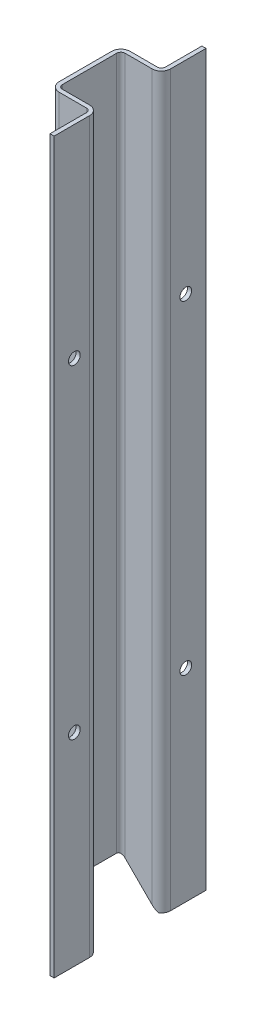
ISO-10303-21;
HEADER;
FILE_DESCRIPTION(('STEP AP214'),'2;1');
FILE_NAME('part.step','',(''),(''),'','','');
FILE_SCHEMA(('AUTOMOTIVE_DESIGN { 1 0 10303 214 1 1 1 1 }'));
ENDSEC;
DATA;
#1=APPLICATION_CONTEXT('core data for automotive mechanical design processes');
#2=APPLICATION_PROTOCOL_DEFINITION('international standard','automotive_design',2000,#1);
#3=PRODUCT_CONTEXT('',#1,'mechanical');
#4=PRODUCT('Part','Part','',(#3));
#5=PRODUCT_RELATED_PRODUCT_CATEGORY('part','',(#4));
#6=PRODUCT_DEFINITION_FORMATION('','',#4);
#7=PRODUCT_DEFINITION_CONTEXT('part definition',#1,'design');
#8=PRODUCT_DEFINITION('design','',#6,#7);
#9=PRODUCT_DEFINITION_SHAPE('','',#8);
#10=(LENGTH_UNIT() NAMED_UNIT(*) SI_UNIT(.MILLI.,.METRE.));
#11=(NAMED_UNIT(*) PLANE_ANGLE_UNIT() SI_UNIT($,.RADIAN.));
#12=(NAMED_UNIT(*) SI_UNIT($,.STERADIAN.) SOLID_ANGLE_UNIT());
#13=UNCERTAINTY_MEASURE_WITH_UNIT(LENGTH_MEASURE(1.E-05),#10,'distance_accuracy_value','');
#14=(GEOMETRIC_REPRESENTATION_CONTEXT(3) GLOBAL_UNCERTAINTY_ASSIGNED_CONTEXT((#13)) GLOBAL_UNIT_ASSIGNED_CONTEXT((#10,
#11,#12)) REPRESENTATION_CONTEXT('',''));
#15=CARTESIAN_POINT('',(0.,0.,0.));
#16=DIRECTION('',(0.,0.,1.));
#17=DIRECTION('',(1.,0.,0.));
#18=AXIS2_PLACEMENT_3D('',#15,#16,#17);
#19=CARTESIAN_POINT('',(162.383781401673,-457.2,-206.271000639954));
#20=DIRECTION('',(0.,0.,-1.));
#21=DIRECTION('',(-1.,0.,0.));
#22=AXIS2_PLACEMENT_3D('',#19,#20,#21);
#23=PLANE('',#22);
#24=DIRECTION('',(-0.707106781186548,0.707106781186548,0.));
#25=VECTOR('',#24,1.);
#26=CARTESIAN_POINT('',(164.092209600915,-446.208428199243,-206.271000639954));
#27=LINE('',#26,#25);
#28=CARTESIAN_POINT('',(172.492981401672,-454.6092,-206.271000639954));
#29=VERTEX_POINT('',#28);
#30=CARTESIAN_POINT('',(155.449581401673,-437.5658,-206.271000639954));
#31=VERTEX_POINT('',#30);
#32=EDGE_CURVE('E318',#29,#31,#27,.T.);
#33=ORIENTED_EDGE('',*,*,#32,.F.);
#34=DIRECTION('',(0.,1.,0.));
#35=VECTOR('',#34,1.);
#36=CARTESIAN_POINT('',(172.492981401672,-457.2,-206.271000639954));
#37=LINE('',#36,#35);
#38=CARTESIAN_POINT('',(172.492981401672,0.,-206.271000639954));
#39=VERTEX_POINT('',#38);
#40=EDGE_CURVE('E285',#29,#39,#37,.T.);
#41=ORIENTED_EDGE('',*,*,#40,.T.);
#42=DIRECTION('',(-1.,0.,0.));
#43=VECTOR('',#42,1.);
#44=CARTESIAN_POINT('',(162.383781401673,0.,-206.271000639954));
#45=LINE('',#44,#43);
#46=CARTESIAN_POINT('',(155.449581401673,0.,-206.271000639954));
#47=VERTEX_POINT('',#46);
#48=EDGE_CURVE('E377',#39,#47,#45,.T.);
#49=ORIENTED_EDGE('',*,*,#48,.T.);
#50=DIRECTION('',(0.,1.,0.));
#51=VECTOR('',#50,1.);
#52=CARTESIAN_POINT('',(155.449581401673,-457.2,-206.271000639954));
#53=LINE('',#52,#51);
#54=EDGE_CURVE('E259',#47,#31,#53,.F.);
#55=ORIENTED_EDGE('',*,*,#54,.T.);
#56=EDGE_LOOP('',(#33,#41,#49,#55));
#57=FACE_BOUND('',#56,.T.);
#58=ADVANCED_FACE('F14',(#57),#23,.F.);
#59=CARTESIAN_POINT('',(163.679181401673,-457.2,-228.496000639954));
#60=DIRECTION('',(0.,-1.,0.));
#61=DIRECTION('',(1.,0.,0.));
#62=AXIS2_PLACEMENT_3D('',#59,#60,#61);
#63=PLANE('',#62);
#64=DIRECTION('',(0.,0.,1.));
#65=VECTOR('',#64,1.);
#66=CARTESIAN_POINT('',(175.083781401672,-457.2,-250.721000639954));
#67=LINE('',#66,#65);
#68=CARTESIAN_POINT('',(175.083781401672,-457.2,-253.311800639953));
#69=VERTEX_POINT('',#68);
#70=CARTESIAN_POINT('',(175.083781401672,-457.2,-249.072959523616));
#71=VERTEX_POINT('',#70);
#72=EDGE_CURVE('E37',#69,#71,#67,.T.);
#73=ORIENTED_EDGE('',*,*,#72,.F.);
#74=DIRECTION('',(0.,0.,-1.));
#75=VECTOR('',#74,1.);
#76=CARTESIAN_POINT('',(175.083781401672,-457.2,-263.421000639953));
#77=LINE('',#76,#75);
#78=CARTESIAN_POINT('',(175.083781401672,-457.2,-276.121000639953));
#79=VERTEX_POINT('',#78);
#80=EDGE_CURVE('E373',#69,#79,#77,.T.);
#81=ORIENTED_EDGE('',*,*,#80,.T.);
#82=DIRECTION('',(1.,0.,0.));
#83=VECTOR('',#82,1.);
#84=CARTESIAN_POINT('',(176.379181401672,-457.2,-276.121000639953));
#85=LINE('',#84,#83);
#86=CARTESIAN_POINT('',(177.674581401672,-457.2,-276.121000639953));
#87=VERTEX_POINT('',#86);
#88=EDGE_CURVE('E376',#79,#87,#85,.T.);
#89=ORIENTED_EDGE('',*,*,#88,.T.);
#90=DIRECTION('',(0.,0.,1.));
#91=VECTOR('',#90,1.);
#92=CARTESIAN_POINT('',(177.674581401672,-457.2,-262.120520639953));
#93=LINE('',#92,#91);
#94=CARTESIAN_POINT('',(177.674581401672,-457.2,-253.885840639953));
#95=VERTEX_POINT('',#94);
#96=EDGE_CURVE('E380',#87,#95,#93,.T.);
#97=ORIENTED_EDGE('',*,*,#96,.T.);
#98=CARTESIAN_POINT('',(171.908781401672,-457.2,-253.885840639953));
#99=DIRECTION('',(0.,-1.,0.));
#100=DIRECTION('',(0.,0.,-1.));
#101=AXIS2_PLACEMENT_3D('',#98,#99,#100);
#102=CIRCLE('',#101,5.7658);
#103=EDGE_CURVE('E236',#95,#71,#102,.T.);
#104=ORIENTED_EDGE('',*,*,#103,.T.);
#105=EDGE_LOOP('',(#73,#81,#89,#97,#104));
#106=FACE_BOUND('',#105,.T.);
#107=ADVANCED_FACE('F482',(#106),#63,.T.);
#108=CARTESIAN_POINT('',(149.683781401672,-457.2,-228.496000639954));
#109=DIRECTION('',(1.,0.,0.));
#110=DIRECTION('',(0.,0.,-1.));
#111=AXIS2_PLACEMENT_3D('',#108,#109,#110);
#112=PLANE('',#111);
#113=DIRECTION('',(0.,1.,0.));
#114=VECTOR('',#113,1.);
#115=CARTESIAN_POINT('',(149.683781401672,-457.2,-244.955200639954));
#116=LINE('',#115,#114);
#117=CARTESIAN_POINT('',(149.683781401672,0.,-244.955200639954));
#118=VERTEX_POINT('',#117);
#119=CARTESIAN_POINT('',(149.683781401672,-431.8,-244.955200639954));
#120=VERTEX_POINT('',#119);
#121=EDGE_CURVE('E219',#118,#120,#116,.F.);
#122=ORIENTED_EDGE('',*,*,#121,.T.);
#123=DIRECTION('',(0.,0.,1.));
#124=VECTOR('',#123,1.);
#125=CARTESIAN_POINT('',(149.683781401672,-431.8,-250.721000639954));
#126=LINE('',#125,#124);
#127=CARTESIAN_POINT('',(149.683781401672,-431.8,-212.036800639953));
#128=VERTEX_POINT('',#127);
#129=EDGE_CURVE('E200',#120,#128,#126,.T.);
#130=ORIENTED_EDGE('',*,*,#129,.T.);
#131=DIRECTION('',(0.,1.,0.));
#132=VECTOR('',#131,1.);
#133=CARTESIAN_POINT('',(149.683781401672,-457.2,-212.036800639953));
#134=LINE('',#133,#132);
#135=CARTESIAN_POINT('',(149.683781401672,0.,-212.036800639953));
#136=VERTEX_POINT('',#135);
#137=EDGE_CURVE('E230',#128,#136,#134,.T.);
#138=ORIENTED_EDGE('',*,*,#137,.T.);
#139=DIRECTION('',(0.,0.,-1.));
#140=VECTOR('',#139,1.);
#141=CARTESIAN_POINT('',(149.683781401672,0.,-228.496000639954));
#142=LINE('',#141,#140);
#143=EDGE_CURVE('E222',#136,#118,#142,.T.);
#144=ORIENTED_EDGE('',*,*,#143,.T.);
#145=EDGE_LOOP('',(#122,#130,#138,#144));
#146=FACE_BOUND('',#145,.T.);
#147=ADVANCED_FACE('F226',(#146),#112,.F.);
#148=CARTESIAN_POINT('',(162.383781401673,-457.2,-250.721000639954));
#149=DIRECTION('',(0.,0.,1.));
#150=DIRECTION('',(1.,0.,0.));
#151=AXIS2_PLACEMENT_3D('',#148,#149,#150);
#152=PLANE('',#151);
#153=DIRECTION('',(1.,0.,0.));
#154=VECTOR('',#153,1.);
#155=CARTESIAN_POINT('',(162.383781401673,0.,-250.721000639954));
#156=LINE('',#155,#154);
#157=CARTESIAN_POINT('',(155.449581401673,0.,-250.721000639954));
#158=VERTEX_POINT('',#157);
#159=CARTESIAN_POINT('',(172.492981401672,0.,-250.721000639954));
#160=VERTEX_POINT('',#159);
#161=EDGE_CURVE('E398',#158,#160,#156,.T.);
#162=ORIENTED_EDGE('',*,*,#161,.T.);
#163=DIRECTION('',(0.,1.,0.));
#164=VECTOR('',#163,1.);
#165=CARTESIAN_POINT('',(172.492981401672,-457.2,-250.721000639954));
#166=LINE('',#165,#164);
#167=CARTESIAN_POINT('',(172.492981401672,-454.6092,-250.721000639954));
#168=VERTEX_POINT('',#167);
#169=EDGE_CURVE('E268',#160,#168,#166,.F.);
#170=ORIENTED_EDGE('',*,*,#169,.T.);
#171=DIRECTION('',(-0.707106781186548,0.707106781186548,0.));
#172=VECTOR('',#171,1.);
#173=CARTESIAN_POINT('',(164.092209600915,-446.208428199243,-250.721000639954));
#174=LINE('',#173,#172);
#175=CARTESIAN_POINT('',(155.449581401673,-437.5658,-250.721000639954));
#176=VERTEX_POINT('',#175);
#177=EDGE_CURVE('E213',#168,#176,#174,.T.);
#178=ORIENTED_EDGE('',*,*,#177,.T.);
#179=DIRECTION('',(0.,1.,0.));
#180=VECTOR('',#179,1.);
#181=CARTESIAN_POINT('',(155.449581401673,-457.2,-250.721000639954));
#182=LINE('',#181,#180);
#183=EDGE_CURVE('E220',#176,#158,#182,.T.);
#184=ORIENTED_EDGE('',*,*,#183,.T.);
#185=EDGE_LOOP('',(#162,#170,#178,#184));
#186=FACE_BOUND('',#185,.T.);
#187=ADVANCED_FACE('F469',(#186),#152,.F.);
#188=CARTESIAN_POINT('',(175.083781401672,-457.2,-263.421000639953));
#189=DIRECTION('',(1.,0.,0.));
#190=DIRECTION('',(0.,0.,-1.));
#191=AXIS2_PLACEMENT_3D('',#188,#189,#190);
#192=PLANE('',#191);
#193=CARTESIAN_POINT('',(175.083781401672,-330.2,-263.421000639953));
#194=DIRECTION('',(1.,0.,0.));
#195=DIRECTION('',(0.,0.,-1.));
#196=AXIS2_PLACEMENT_3D('',#193,#194,#195);
#197=CIRCLE('',#196,3.683);
#198=CARTESIAN_POINT('',(175.083781401672,-330.2,-267.104000639953));
#199=VERTEX_POINT('',#198);
#200=EDGE_CURVE('E18',#199,#199,#197,.F.);
#201=ORIENTED_EDGE('',*,*,#200,.F.);
#202=EDGE_LOOP('',(#201));
#203=FACE_BOUND('',#202,.T.);
#204=CARTESIAN_POINT('',(175.083781401672,-127.,-263.421000639953));
#205=DIRECTION('',(1.,0.,0.));
#206=DIRECTION('',(0.,0.,-1.));
#207=AXIS2_PLACEMENT_3D('',#204,#205,#206);
#208=CIRCLE('',#207,3.683);
#209=CARTESIAN_POINT('',(175.083781401672,-127.,-267.104000639953));
#210=VERTEX_POINT('',#209);
#211=EDGE_CURVE('E324',#210,#210,#208,.F.);
#212=ORIENTED_EDGE('',*,*,#211,.F.);
#213=EDGE_LOOP('',(#212));
#214=FACE_BOUND('',#213,.T.);
#215=ORIENTED_EDGE('',*,*,#80,.F.);
#216=DIRECTION('',(0.,1.,0.));
#217=VECTOR('',#216,1.);
#218=CARTESIAN_POINT('',(175.083781401672,0.,-253.311800639953));
#219=LINE('',#218,#217);
#220=CARTESIAN_POINT('',(175.083781401672,0.,-253.311800639953));
#221=VERTEX_POINT('',#220);
#222=EDGE_CURVE('E264',#69,#221,#219,.T.);
#223=ORIENTED_EDGE('',*,*,#222,.T.);
#224=DIRECTION('',(0.,0.,-1.));
#225=VECTOR('',#224,1.);
#226=CARTESIAN_POINT('',(175.083781401672,0.,-263.421000639953));
#227=LINE('',#226,#225);
#228=CARTESIAN_POINT('',(175.083781401672,0.,-276.121000639953));
#229=VERTEX_POINT('',#228);
#230=EDGE_CURVE('E402',#221,#229,#227,.T.);
#231=ORIENTED_EDGE('',*,*,#230,.T.);
#232=DIRECTION('',(0.,1.,0.));
#233=VECTOR('',#232,1.);
#234=CARTESIAN_POINT('',(175.083781401672,-457.2,-276.121000639953));
#235=LINE('',#234,#233);
#236=EDGE_CURVE('E446',#79,#229,#235,.T.);
#237=ORIENTED_EDGE('',*,*,#236,.F.);
#238=EDGE_LOOP('',(#215,#223,#231,#237));
#239=FACE_BOUND('',#238,.T.);
#240=ADVANCED_FACE('F596',(#203,#214,#239),#192,.F.);
#241=CARTESIAN_POINT('',(176.379181401672,-457.2,-276.121000639953));
#242=DIRECTION('',(0.,0.,1.));
#243=DIRECTION('',(1.,0.,0.));
#244=AXIS2_PLACEMENT_3D('',#241,#242,#243);
#245=PLANE('',#244);
#246=DIRECTION('',(1.,0.,0.));
#247=VECTOR('',#246,1.);
#248=CARTESIAN_POINT('',(176.379181401672,0.,-276.121000639953));
#249=LINE('',#248,#247);
#250=CARTESIAN_POINT('',(177.674581401672,0.,-276.121000639953));
#251=VERTEX_POINT('',#250);
#252=EDGE_CURVE('E405',#229,#251,#249,.T.);
#253=ORIENTED_EDGE('',*,*,#252,.T.);
#254=DIRECTION('',(0.,1.,0.));
#255=VECTOR('',#254,1.);
#256=CARTESIAN_POINT('',(177.674581401672,-457.2,-276.121000639953));
#257=LINE('',#256,#255);
#258=EDGE_CURVE('E442',#87,#251,#257,.T.);
#259=ORIENTED_EDGE('',*,*,#258,.F.);
#260=ORIENTED_EDGE('',*,*,#88,.F.);
#261=ORIENTED_EDGE('',*,*,#236,.T.);
#262=EDGE_LOOP('',(#253,#259,#260,#261));
#263=FACE_BOUND('',#262,.T.);
#264=ADVANCED_FACE('F716',(#263),#245,.F.);
#265=CARTESIAN_POINT('',(177.674581401672,-457.2,-262.120520639953));
#266=DIRECTION('',(-1.,0.,0.));
#267=DIRECTION('',(0.,0.,1.));
#268=AXIS2_PLACEMENT_3D('',#265,#266,#267);
#269=PLANE('',#268);
#270=CARTESIAN_POINT('',(177.674581401672,-330.2,-263.421000639953));
#271=DIRECTION('',(1.,0.,0.));
#272=DIRECTION('',(0.,0.,-1.));
#273=AXIS2_PLACEMENT_3D('',#270,#271,#272);
#274=CIRCLE('',#273,3.683);
#275=CARTESIAN_POINT('',(177.674581401672,-330.2,-267.104000639953));
#276=VERTEX_POINT('',#275);
#277=EDGE_CURVE('E344',#276,#276,#274,.T.);
#278=ORIENTED_EDGE('',*,*,#277,.F.);
#279=EDGE_LOOP('',(#278));
#280=FACE_BOUND('',#279,.T.);
#281=CARTESIAN_POINT('',(177.674581401672,-127.,-263.421000639953));
#282=DIRECTION('',(1.,0.,0.));
#283=DIRECTION('',(0.,0.,-1.));
#284=AXIS2_PLACEMENT_3D('',#281,#282,#283);
#285=CIRCLE('',#284,3.683);
#286=CARTESIAN_POINT('',(177.674581401672,-127.,-267.104000639953));
#287=VERTEX_POINT('',#286);
#288=EDGE_CURVE('E327',#287,#287,#285,.T.);
#289=ORIENTED_EDGE('',*,*,#288,.F.);
#290=EDGE_LOOP('',(#289));
#291=FACE_BOUND('',#290,.T.);
#292=DIRECTION('',(0.,0.,1.));
#293=VECTOR('',#292,1.);
#294=CARTESIAN_POINT('',(177.674581401672,0.,-262.120520639953));
#295=LINE('',#294,#293);
#296=CARTESIAN_POINT('',(177.674581401672,0.,-253.885840639953));
#297=VERTEX_POINT('',#296);
#298=EDGE_CURVE('E408',#251,#297,#295,.T.);
#299=ORIENTED_EDGE('',*,*,#298,.T.);
#300=DIRECTION('',(0.,1.,0.));
#301=VECTOR('',#300,1.);
#302=CARTESIAN_POINT('',(177.674581401672,-457.2,-253.885840639953));
#303=LINE('',#302,#301);
#304=EDGE_CURVE('E248',#297,#95,#303,.F.);
#305=ORIENTED_EDGE('',*,*,#304,.T.);
#306=ORIENTED_EDGE('',*,*,#96,.F.);
#307=ORIENTED_EDGE('',*,*,#258,.T.);
#308=EDGE_LOOP('',(#299,#305,#306,#307));
#309=FACE_BOUND('',#308,.T.);
#310=ADVANCED_FACE('F487',(#280,#291,#309),#269,.F.);
#311=CARTESIAN_POINT('',(176.379181401672,-457.2,-248.120040639953));
#312=DIRECTION('',(0.,0.,-1.));
#313=DIRECTION('',(-1.,0.,0.));
#314=AXIS2_PLACEMENT_3D('',#311,#312,#313);
#315=PLANE('',#314);
#316=DIRECTION('',(-1.,0.,0.));
#317=VECTOR('',#316,1.);
#318=CARTESIAN_POINT('',(176.379181401672,0.,-248.120040639953));
#319=LINE('',#318,#317);
#320=CARTESIAN_POINT('',(171.908781401672,0.,-248.120040639953));
#321=VERTEX_POINT('',#320);
#322=CARTESIAN_POINT('',(154.875541401673,0.,-248.120040639953));
#323=VERTEX_POINT('',#322);
#324=EDGE_CURVE('E412',#321,#323,#319,.T.);
#325=ORIENTED_EDGE('',*,*,#324,.T.);
#326=DIRECTION('',(0.,1.,0.));
#327=VECTOR('',#326,1.);
#328=CARTESIAN_POINT('',(154.875541401673,-434.40096,-248.120040639953));
#329=LINE('',#328,#327);
#330=CARTESIAN_POINT('',(154.875541401673,-436.99176,-248.120040639953));
#331=VERTEX_POINT('',#330);
#332=EDGE_CURVE('E278',#323,#331,#329,.F.);
#333=ORIENTED_EDGE('',*,*,#332,.T.);
#334=DIRECTION('',(0.707106781186548,-0.707106781186548,0.));
#335=VECTOR('',#334,1.);
#336=CARTESIAN_POINT('',(175.731481401672,-457.8477,-248.120040639953));
#337=LINE('',#336,#335);
#338=CARTESIAN_POINT('',(171.908781401672,-454.025,-248.120040639953));
#339=VERTEX_POINT('',#338);
#340=EDGE_CURVE('E367',#331,#339,#337,.T.);
#341=ORIENTED_EDGE('',*,*,#340,.T.);
#342=DIRECTION('',(0.,1.,0.));
#343=VECTOR('',#342,1.);
#344=CARTESIAN_POINT('',(171.908781401672,-457.2,-248.120040639953));
#345=LINE('',#344,#343);
#346=EDGE_CURVE('E245',#339,#321,#345,.T.);
#347=ORIENTED_EDGE('',*,*,#346,.T.);
#348=EDGE_LOOP('',(#325,#333,#341,#347));
#349=FACE_BOUND('',#348,.T.);
#350=ADVANCED_FACE('F493',(#349),#315,.F.);
#351=CARTESIAN_POINT('',(152.284741401673,-457.2,-228.496000639954));
#352=DIRECTION('',(-1.,0.,0.));
#353=DIRECTION('',(0.,0.,1.));
#354=AXIS2_PLACEMENT_3D('',#351,#352,#353);
#355=PLANE('',#354);
#356=DIRECTION('',(0.,0.,-1.));
#357=VECTOR('',#356,1.);
#358=CARTESIAN_POINT('',(152.284741401673,-434.40096,-228.496000639954));
#359=LINE('',#358,#357);
#360=CARTESIAN_POINT('',(152.284741401673,-434.40096,-211.462760639954));
#361=VERTEX_POINT('',#360);
#362=CARTESIAN_POINT('',(152.284741401673,-434.40096,-245.529240639954));
#363=VERTEX_POINT('',#362);
#364=EDGE_CURVE('E363',#361,#363,#359,.T.);
#365=ORIENTED_EDGE('',*,*,#364,.T.);
#366=DIRECTION('',(0.,1.,0.));
#367=VECTOR('',#366,1.);
#368=CARTESIAN_POINT('',(152.284741401673,0.,-245.529240639954));
#369=LINE('',#368,#367);
#370=CARTESIAN_POINT('',(152.284741401673,0.,-245.529240639954));
#371=VERTEX_POINT('',#370);
#372=EDGE_CURVE('E274',#363,#371,#369,.T.);
#373=ORIENTED_EDGE('',*,*,#372,.T.);
#374=DIRECTION('',(0.,0.,1.));
#375=VECTOR('',#374,1.);
#376=CARTESIAN_POINT('',(152.284741401673,0.,-228.496000639954));
#377=LINE('',#376,#375);
#378=CARTESIAN_POINT('',(152.284741401673,0.,-211.462760639954));
#379=VERTEX_POINT('',#378);
#380=EDGE_CURVE('E416',#371,#379,#377,.T.);
#381=ORIENTED_EDGE('',*,*,#380,.T.);
#382=DIRECTION('',(0.,1.,0.));
#383=VECTOR('',#382,1.);
#384=CARTESIAN_POINT('',(152.284741401673,-434.40096,-211.462760639954));
#385=LINE('',#384,#383);
#386=EDGE_CURVE('E271',#379,#361,#385,.F.);
#387=ORIENTED_EDGE('',*,*,#386,.T.);
#388=EDGE_LOOP('',(#365,#373,#381,#387));
#389=FACE_BOUND('',#388,.T.);
#390=ADVANCED_FACE('F501',(#389),#355,.F.);
#391=CARTESIAN_POINT('',(163.684261401673,-457.2,-208.871960639953));
#392=DIRECTION('',(0.,0.,1.));
#393=DIRECTION('',(1.,0.,0.));
#394=AXIS2_PLACEMENT_3D('',#391,#392,#393);
#395=PLANE('',#394);
#396=DIRECTION('',(-0.707106781186548,0.707106781186548,0.));
#397=VECTOR('',#396,1.);
#398=CARTESIAN_POINT('',(169.384021401672,-451.50024,-208.871960639953));
#399=LINE('',#398,#397);
#400=CARTESIAN_POINT('',(171.908781401672,-454.025,-208.871960639953));
#401=VERTEX_POINT('',#400);
#402=CARTESIAN_POINT('',(154.875541401673,-436.99176,-208.871960639953));
#403=VERTEX_POINT('',#402);
#404=EDGE_CURVE('E359',#401,#403,#399,.T.);
#405=ORIENTED_EDGE('',*,*,#404,.T.);
#406=DIRECTION('',(0.,1.,0.));
#407=VECTOR('',#406,1.);
#408=CARTESIAN_POINT('',(154.875541401673,0.,-208.871960639953));
#409=LINE('',#408,#407);
#410=CARTESIAN_POINT('',(154.875541401673,0.,-208.871960639953));
#411=VERTEX_POINT('',#410);
#412=EDGE_CURVE('E281',#403,#411,#409,.T.);
#413=ORIENTED_EDGE('',*,*,#412,.T.);
#414=DIRECTION('',(1.,0.,0.));
#415=VECTOR('',#414,1.);
#416=CARTESIAN_POINT('',(163.684261401673,0.,-208.871960639953));
#417=LINE('',#416,#415);
#418=CARTESIAN_POINT('',(171.908781401672,0.,-208.871960639953));
#419=VERTEX_POINT('',#418);
#420=EDGE_CURVE('E420',#411,#419,#417,.T.);
#421=ORIENTED_EDGE('',*,*,#420,.T.);
#422=DIRECTION('',(0.,1.,0.));
#423=VECTOR('',#422,1.);
#424=CARTESIAN_POINT('',(171.908781401672,-457.2,-208.871960639953));
#425=LINE('',#424,#423);
#426=EDGE_CURVE('E255',#419,#401,#425,.F.);
#427=ORIENTED_EDGE('',*,*,#426,.T.);
#428=EDGE_LOOP('',(#405,#413,#421,#427));
#429=FACE_BOUND('',#428,.T.);
#430=ADVANCED_FACE('F508',(#429),#395,.F.);
#431=CARTESIAN_POINT('',(177.674581401672,-457.2,-194.871480639954));
#432=DIRECTION('',(1.,0.,0.));
#433=DIRECTION('',(0.,0.,-1.));
#434=AXIS2_PLACEMENT_3D('',#431,#432,#433);
#435=PLANE('',#434);
#436=CARTESIAN_POINT('',(177.674581401672,-127.,-193.571000639953));
#437=DIRECTION('',(1.,0.,0.));
#438=DIRECTION('',(0.,0.,-1.));
#439=AXIS2_PLACEMENT_3D('',#436,#437,#438);
#440=CIRCLE('',#439,3.683);
#441=CARTESIAN_POINT('',(177.674581401672,-127.,-197.254000639953));
#442=VERTEX_POINT('',#441);
#443=EDGE_CURVE('E323',#442,#442,#440,.T.);
#444=ORIENTED_EDGE('',*,*,#443,.F.);
#445=EDGE_LOOP('',(#444));
#446=FACE_BOUND('',#445,.T.);
#447=CARTESIAN_POINT('',(177.674581401672,-330.2,-193.571000639953));
#448=DIRECTION('',(1.,0.,0.));
#449=DIRECTION('',(0.,0.,-1.));
#450=AXIS2_PLACEMENT_3D('',#447,#448,#449);
#451=CIRCLE('',#450,3.683);
#452=CARTESIAN_POINT('',(177.674581401672,-330.2,-197.254000639953));
#453=VERTEX_POINT('',#452);
#454=EDGE_CURVE('E319',#453,#453,#451,.T.);
#455=ORIENTED_EDGE('',*,*,#454,.F.);
#456=EDGE_LOOP('',(#455));
#457=FACE_BOUND('',#456,.T.);
#458=DIRECTION('',(0.,0.,-1.));
#459=VECTOR('',#458,1.);
#460=CARTESIAN_POINT('',(177.674581401672,-457.2,-194.871480639954));
#461=LINE('',#460,#459);
#462=CARTESIAN_POINT('',(177.674581401672,-457.2,-180.871000639954));
#463=VERTEX_POINT('',#462);
#464=CARTESIAN_POINT('',(177.674581401672,-457.2,-203.106160639954));
#465=VERTEX_POINT('',#464);
#466=EDGE_CURVE('E384',#463,#465,#461,.T.);
#467=ORIENTED_EDGE('',*,*,#466,.T.);
#468=DIRECTION('',(0.,1.,0.));
#469=VECTOR('',#468,1.);
#470=CARTESIAN_POINT('',(177.674581401672,0.,-203.106160639954));
#471=LINE('',#470,#469);
#472=CARTESIAN_POINT('',(177.674581401672,0.,-203.106160639954));
#473=VERTEX_POINT('',#472);
#474=EDGE_CURVE('E251',#465,#473,#471,.T.);
#475=ORIENTED_EDGE('',*,*,#474,.T.);
#476=DIRECTION('',(0.,0.,-1.));
#477=VECTOR('',#476,1.);
#478=CARTESIAN_POINT('',(177.674581401672,0.,-194.871480639954));
#479=LINE('',#478,#477);
#480=CARTESIAN_POINT('',(177.674581401672,0.,-180.871000639954));
#481=VERTEX_POINT('',#480);
#482=EDGE_CURVE('E423',#481,#473,#479,.T.);
#483=ORIENTED_EDGE('',*,*,#482,.F.);
#484=DIRECTION('',(0.,1.,0.));
#485=VECTOR('',#484,1.);
#486=CARTESIAN_POINT('',(177.674581401672,-457.2,-180.871000639954));
#487=LINE('',#486,#485);
#488=EDGE_CURVE('E439',#463,#481,#487,.T.);
#489=ORIENTED_EDGE('',*,*,#488,.F.);
#490=EDGE_LOOP('',(#467,#475,#483,#489));
#491=FACE_BOUND('',#490,.T.);
#492=ADVANCED_FACE('F614',(#446,#457,#491),#435,.T.);
#493=CARTESIAN_POINT('',(176.379181401672,-457.2,-180.871000639954));
#494=DIRECTION('',(0.,0.,1.));
#495=DIRECTION('',(1.,0.,0.));
#496=AXIS2_PLACEMENT_3D('',#493,#494,#495);
#497=PLANE('',#496);
#498=DIRECTION('',(1.,0.,0.));
#499=VECTOR('',#498,1.);
#500=CARTESIAN_POINT('',(176.379181401672,0.,-180.871000639954));
#501=LINE('',#500,#499);
#502=CARTESIAN_POINT('',(175.083781401672,0.,-180.871000639954));
#503=VERTEX_POINT('',#502);
#504=EDGE_CURVE('E427',#503,#481,#501,.T.);
#505=ORIENTED_EDGE('',*,*,#504,.F.);
#506=DIRECTION('',(0.,1.,0.));
#507=VECTOR('',#506,1.);
#508=CARTESIAN_POINT('',(175.083781401672,-457.2,-180.871000639954));
#509=LINE('',#508,#507);
#510=CARTESIAN_POINT('',(175.083781401672,-457.2,-180.871000639954));
#511=VERTEX_POINT('',#510);
#512=EDGE_CURVE('E395',#511,#503,#509,.T.);
#513=ORIENTED_EDGE('',*,*,#512,.F.);
#514=DIRECTION('',(1.,0.,0.));
#515=VECTOR('',#514,1.);
#516=CARTESIAN_POINT('',(176.379181401672,-457.2,-180.871000639954));
#517=LINE('',#516,#515);
#518=EDGE_CURVE('E388',#511,#463,#517,.T.);
#519=ORIENTED_EDGE('',*,*,#518,.T.);
#520=ORIENTED_EDGE('',*,*,#488,.T.);
#521=EDGE_LOOP('',(#505,#513,#519,#520));
#522=FACE_BOUND('',#521,.T.);
#523=ADVANCED_FACE('F671',(#522),#497,.T.);
#524=CARTESIAN_POINT('',(175.083781401672,-457.2,-193.571000639953));
#525=DIRECTION('',(-1.,0.,0.));
#526=DIRECTION('',(0.,0.,1.));
#527=AXIS2_PLACEMENT_3D('',#524,#525,#526);
#528=PLANE('',#527);
#529=CARTESIAN_POINT('',(175.083781401672,-127.,-193.571000639953));
#530=DIRECTION('',(-1.,0.,0.));
#531=DIRECTION('',(0.,0.,1.));
#532=AXIS2_PLACEMENT_3D('',#529,#530,#531);
#533=CIRCLE('',#532,3.683);
#534=CARTESIAN_POINT('',(175.083781401672,-127.,-189.888000639954));
#535=VERTEX_POINT('',#534);
#536=EDGE_CURVE('E320',#535,#535,#533,.F.);
#537=ORIENTED_EDGE('',*,*,#536,.T.);
#538=EDGE_LOOP('',(#537));
#539=FACE_BOUND('',#538,.T.);
#540=CARTESIAN_POINT('',(175.083781401672,-330.2,-193.571000639953));
#541=DIRECTION('',(-1.,0.,0.));
#542=DIRECTION('',(0.,0.,1.));
#543=AXIS2_PLACEMENT_3D('',#540,#541,#542);
#544=CIRCLE('',#543,3.683);
#545=CARTESIAN_POINT('',(175.083781401672,-330.2,-189.888000639954));
#546=VERTEX_POINT('',#545);
#547=EDGE_CURVE('E314',#546,#546,#544,.F.);
#548=ORIENTED_EDGE('',*,*,#547,.T.);
#549=EDGE_LOOP('',(#548));
#550=FACE_BOUND('',#549,.T.);
#551=DIRECTION('',(0.,0.,1.));
#552=VECTOR('',#551,1.);
#553=CARTESIAN_POINT('',(175.083781401672,0.,-193.571000639953));
#554=LINE('',#553,#552);
#555=CARTESIAN_POINT('',(175.083781401672,0.,-203.680200639954));
#556=VERTEX_POINT('',#555);
#557=EDGE_CURVE('E431',#556,#503,#554,.T.);
#558=ORIENTED_EDGE('',*,*,#557,.F.);
#559=DIRECTION('',(0.,1.,0.));
#560=VECTOR('',#559,1.);
#561=CARTESIAN_POINT('',(175.083781401672,-457.2,-203.680200639954));
#562=LINE('',#561,#560);
#563=CARTESIAN_POINT('',(175.083781401672,-457.2,-203.680200639954));
#564=VERTEX_POINT('',#563);
#565=EDGE_CURVE('E289',#556,#564,#562,.F.);
#566=ORIENTED_EDGE('',*,*,#565,.T.);
#567=DIRECTION('',(0.,0.,1.));
#568=VECTOR('',#567,1.);
#569=CARTESIAN_POINT('',(175.083781401672,-457.2,-193.571000639953));
#570=LINE('',#569,#568);
#571=EDGE_CURVE('E392',#564,#511,#570,.T.);
#572=ORIENTED_EDGE('',*,*,#571,.T.);
#573=ORIENTED_EDGE('',*,*,#512,.T.);
#574=EDGE_LOOP('',(#558,#566,#572,#573));
#575=FACE_BOUND('',#574,.T.);
#576=ADVANCED_FACE('F639',(#539,#550,#575),#528,.T.);
#577=CARTESIAN_POINT('',(175.083781401672,-457.2,-207.919041756292));
#578=VERTEX_POINT('',#577);
#579=EDGE_CURVE('E212',#578,#564,#67,.T.);
#580=ORIENTED_EDGE('',*,*,#579,.F.);
#581=CARTESIAN_POINT('',(171.908781401672,-457.2,-203.106160639954));
#582=DIRECTION('',(0.,-1.,0.));
#583=DIRECTION('',(0.,0.,-1.));
#584=AXIS2_PLACEMENT_3D('',#581,#582,#583);
#585=CIRCLE('',#584,5.7658);
#586=EDGE_CURVE('E229',#578,#465,#585,.T.);
#587=ORIENTED_EDGE('',*,*,#586,.T.);
#588=ORIENTED_EDGE('',*,*,#466,.F.);
#589=ORIENTED_EDGE('',*,*,#518,.F.);
#590=ORIENTED_EDGE('',*,*,#571,.F.);
#591=EDGE_LOOP('',(#580,#587,#588,#589,#590));
#592=FACE_BOUND('',#591,.T.);
#593=ADVANCED_FACE('F518',(#592),#63,.T.);
#594=CARTESIAN_POINT('',(163.679181401673,0.,-228.496000639954));
#595=DIRECTION('',(0.,-1.,0.));
#596=DIRECTION('',(1.,0.,0.));
#597=AXIS2_PLACEMENT_3D('',#594,#595,#596);
#598=PLANE('',#597);
#599=ORIENTED_EDGE('',*,*,#161,.F.);
#600=CARTESIAN_POINT('',(155.449581401673,0.,-244.955200639954));
#601=DIRECTION('',(0.,-1.,0.));
#602=DIRECTION('',(0.,0.,-1.));
#603=AXIS2_PLACEMENT_3D('',#600,#601,#602);
#604=CIRCLE('',#603,5.7658);
#605=EDGE_CURVE('E239',#158,#118,#604,.F.);
#606=ORIENTED_EDGE('',*,*,#605,.T.);
#607=ORIENTED_EDGE('',*,*,#143,.F.);
#608=CARTESIAN_POINT('',(155.449581401673,0.,-212.036800639953));
#609=DIRECTION('',(0.,-1.,0.));
#610=DIRECTION('',(0.,0.,-1.));
#611=AXIS2_PLACEMENT_3D('',#608,#609,#610);
#612=CIRCLE('',#611,5.7658);
#613=EDGE_CURVE('E451',#136,#47,#612,.F.);
#614=ORIENTED_EDGE('',*,*,#613,.T.);
#615=ORIENTED_EDGE('',*,*,#48,.F.);
#616=CARTESIAN_POINT('',(172.492981401672,0.,-203.680200639954));
#617=DIRECTION('',(0.,-1.,0.));
#618=DIRECTION('',(0.,0.,-1.));
#619=AXIS2_PLACEMENT_3D('',#616,#617,#618);
#620=CIRCLE('',#619,2.5908);
#621=EDGE_CURVE('E25',#39,#556,#620,.T.);
#622=ORIENTED_EDGE('',*,*,#621,.T.);
#623=ORIENTED_EDGE('',*,*,#557,.T.);
#624=ORIENTED_EDGE('',*,*,#504,.T.);
#625=ORIENTED_EDGE('',*,*,#482,.T.);
#626=CARTESIAN_POINT('',(171.908781401672,0.,-203.106160639954));
#627=DIRECTION('',(0.,-1.,0.));
#628=DIRECTION('',(0.,0.,-1.));
#629=AXIS2_PLACEMENT_3D('',#626,#627,#628);
#630=CIRCLE('',#629,5.7658);
#631=EDGE_CURVE('E455',#473,#419,#630,.F.);
#632=ORIENTED_EDGE('',*,*,#631,.T.);
#633=ORIENTED_EDGE('',*,*,#420,.F.);
#634=CARTESIAN_POINT('',(154.875541401673,0.,-211.462760639954));
#635=DIRECTION('',(0.,-1.,0.));
#636=DIRECTION('',(0.,0.,-1.));
#637=AXIS2_PLACEMENT_3D('',#634,#635,#636);
#638=CIRCLE('',#637,2.5908);
#639=EDGE_CURVE('E306',#411,#379,#638,.T.);
#640=ORIENTED_EDGE('',*,*,#639,.T.);
#641=ORIENTED_EDGE('',*,*,#380,.F.);
#642=CARTESIAN_POINT('',(154.875541401673,0.,-245.529240639954));
#643=DIRECTION('',(0.,-1.,0.));
#644=DIRECTION('',(0.,0.,-1.));
#645=AXIS2_PLACEMENT_3D('',#642,#643,#644);
#646=CIRCLE('',#645,2.5908);
#647=EDGE_CURVE('E300',#371,#323,#646,.T.);
#648=ORIENTED_EDGE('',*,*,#647,.T.);
#649=ORIENTED_EDGE('',*,*,#324,.F.);
#650=CARTESIAN_POINT('',(171.908781401672,0.,-253.885840639953));
#651=DIRECTION('',(0.,-1.,0.));
#652=DIRECTION('',(0.,0.,-1.));
#653=AXIS2_PLACEMENT_3D('',#650,#651,#652);
#654=CIRCLE('',#653,5.7658);
#655=EDGE_CURVE('E459',#321,#297,#654,.F.);
#656=ORIENTED_EDGE('',*,*,#655,.T.);
#657=ORIENTED_EDGE('',*,*,#298,.F.);
#658=ORIENTED_EDGE('',*,*,#252,.F.);
#659=ORIENTED_EDGE('',*,*,#230,.F.);
#660=CARTESIAN_POINT('',(172.492981401672,0.,-253.311800639953));
#661=DIRECTION('',(0.,-1.,0.));
#662=DIRECTION('',(0.,0.,-1.));
#663=AXIS2_PLACEMENT_3D('',#660,#661,#662);
#664=CIRCLE('',#663,2.5908);
#665=EDGE_CURVE('E293',#221,#160,#664,.T.);
#666=ORIENTED_EDGE('',*,*,#665,.T.);
#667=EDGE_LOOP('',(#599,#606,#607,#614,#615,#622,#623,#624,#625,#632,#633,#640,#641,#648,#649,
#656,#657,#658,#659,#666));
#668=FACE_BOUND('',#667,.T.);
#669=ADVANCED_FACE('F465',(#668),#598,.F.);
#670=CARTESIAN_POINT('',(155.449581401673,-457.2,-244.955200639954));
#671=DIRECTION('',(0.,1.,0.));
#672=DIRECTION('',(0.,0.,1.));
#673=AXIS2_PLACEMENT_3D('',#670,#671,#672);
#674=CYLINDRICAL_SURFACE('',#673,5.7658);
#675=CARTESIAN_POINT('',(155.449581401673,-437.5658,-244.955200639954));
#676=DIRECTION('',(0.707106781186547,0.707106781186548,0.));
#677=DIRECTION('',(-0.707106781186548,0.707106781186547,0.));
#678=AXIS2_PLACEMENT_3D('',#675,#676,#677);
#679=ELLIPSE('',#678,8.15407255793079,5.7658);
#680=EDGE_CURVE('E204',#120,#176,#679,.F.);
#681=ORIENTED_EDGE('',*,*,#680,.F.);
#682=ORIENTED_EDGE('',*,*,#121,.F.);
#683=ORIENTED_EDGE('',*,*,#605,.F.);
#684=ORIENTED_EDGE('',*,*,#183,.F.);
#685=EDGE_LOOP('',(#681,#682,#683,#684));
#686=FACE_BOUND('',#685,.T.);
#687=ADVANCED_FACE('F217',(#686),#674,.T.);
#688=CARTESIAN_POINT('',(171.908781401672,-457.2,-253.885840639953));
#689=DIRECTION('',(0.,1.,0.));
#690=DIRECTION('',(0.,0.,1.));
#691=AXIS2_PLACEMENT_3D('',#688,#689,#690);
#692=CYLINDRICAL_SURFACE('',#691,5.7658);
#693=CARTESIAN_POINT('',(171.908781401672,-454.025,-253.885840639953));
#694=DIRECTION('',(0.707106781186547,0.707106781186548,0.));
#695=DIRECTION('',(-0.707106781186548,0.707106781186547,0.));
#696=AXIS2_PLACEMENT_3D('',#693,#694,#695);
#697=ELLIPSE('',#696,8.15407255793079,5.7658);
#698=EDGE_CURVE('E223',#71,#339,#697,.F.);
#699=ORIENTED_EDGE('',*,*,#698,.F.);
#700=ORIENTED_EDGE('',*,*,#103,.F.);
#701=ORIENTED_EDGE('',*,*,#304,.F.);
#702=ORIENTED_EDGE('',*,*,#655,.F.);
#703=ORIENTED_EDGE('',*,*,#346,.F.);
#704=EDGE_LOOP('',(#699,#700,#701,#702,#703));
#705=FACE_BOUND('',#704,.T.);
#706=ADVANCED_FACE('F479',(#705),#692,.T.);
#707=CARTESIAN_POINT('',(171.908781401672,-457.2,-203.106160639954));
#708=DIRECTION('',(0.,-1.,0.));
#709=DIRECTION('',(0.,0.,-1.));
#710=AXIS2_PLACEMENT_3D('',#707,#708,#709);
#711=CYLINDRICAL_SURFACE('',#710,5.7658);
#712=CARTESIAN_POINT('',(171.908781401672,-454.025,-203.106160639954));
#713=DIRECTION('',(0.707106781186547,0.707106781186548,0.));
#714=DIRECTION('',(0.707106781186548,-0.707106781186547,0.));
#715=AXIS2_PLACEMENT_3D('',#712,#713,#714);
#716=ELLIPSE('',#715,8.15407255793079,5.7658);
#717=EDGE_CURVE('E356',#401,#578,#716,.F.);
#718=ORIENTED_EDGE('',*,*,#717,.F.);
#719=ORIENTED_EDGE('',*,*,#426,.F.);
#720=ORIENTED_EDGE('',*,*,#631,.F.);
#721=ORIENTED_EDGE('',*,*,#474,.F.);
#722=ORIENTED_EDGE('',*,*,#586,.F.);
#723=EDGE_LOOP('',(#718,#719,#720,#721,#722));
#724=FACE_BOUND('',#723,.T.);
#725=ADVANCED_FACE('F512',(#724),#711,.T.);
#726=CARTESIAN_POINT('',(155.449581401673,-457.2,-212.036800639953));
#727=DIRECTION('',(0.,1.,0.));
#728=DIRECTION('',(0.,0.,1.));
#729=AXIS2_PLACEMENT_3D('',#726,#727,#728);
#730=CYLINDRICAL_SURFACE('',#729,5.7658);
#731=CARTESIAN_POINT('',(155.449581401673,-437.5658,-212.036800639953));
#732=DIRECTION('',(0.707106781186547,0.707106781186548,0.));
#733=DIRECTION('',(-0.707106781186548,0.707106781186547,0.));
#734=AXIS2_PLACEMENT_3D('',#731,#732,#733);
#735=ELLIPSE('',#734,8.15407255793079,5.7658);
#736=EDGE_CURVE('E207',#31,#128,#735,.F.);
#737=ORIENTED_EDGE('',*,*,#736,.F.);
#738=ORIENTED_EDGE('',*,*,#54,.F.);
#739=ORIENTED_EDGE('',*,*,#613,.F.);
#740=ORIENTED_EDGE('',*,*,#137,.F.);
#741=EDGE_LOOP('',(#737,#738,#739,#740));
#742=FACE_BOUND('',#741,.T.);
#743=ADVANCED_FACE('F576',(#742),#730,.T.);
#744=CARTESIAN_POINT('',(164.092209600915,-446.208428199243,-250.721000639954));
#745=DIRECTION('',(0.707106781186547,0.707106781186548,0.));
#746=DIRECTION('',(-0.707106781186548,0.707106781186547,0.));
#747=AXIS2_PLACEMENT_3D('',#744,#745,#746);
#748=PLANE('',#747);
#749=ORIENTED_EDGE('',*,*,#680,.T.);
#750=ORIENTED_EDGE('',*,*,#177,.F.);
#751=CARTESIAN_POINT('',(172.492981401672,-454.6092,-253.311800639953));
#752=DIRECTION('',(0.707106781186547,0.707106781186548,0.));
#753=DIRECTION('',(0.707106781186548,-0.707106781186547,0.));
#754=AXIS2_PLACEMENT_3D('',#751,#752,#753);
#755=ELLIPSE('',#754,3.66394449739622,2.5908);
#756=EDGE_CURVE('E296',#168,#69,#755,.T.);
#757=ORIENTED_EDGE('',*,*,#756,.T.);
#758=ORIENTED_EDGE('',*,*,#72,.T.);
#759=ORIENTED_EDGE('',*,*,#698,.T.);
#760=ORIENTED_EDGE('',*,*,#340,.F.);
#761=CARTESIAN_POINT('',(154.875541401673,-436.99176,-245.529240639954));
#762=DIRECTION('',(0.707106781186547,0.707106781186548,0.));
#763=DIRECTION('',(0.707106781186548,-0.707106781186547,0.));
#764=AXIS2_PLACEMENT_3D('',#761,#762,#763);
#765=ELLIPSE('',#764,3.66394449739622,2.5908);
#766=EDGE_CURVE('E303',#331,#363,#765,.T.);
#767=ORIENTED_EDGE('',*,*,#766,.T.);
#768=ORIENTED_EDGE('',*,*,#364,.F.);
#769=CARTESIAN_POINT('',(154.875541401673,-436.99176,-211.462760639954));
#770=DIRECTION('',(0.707106781186547,0.707106781186548,0.));
#771=DIRECTION('',(0.707106781186548,-0.707106781186547,0.));
#772=AXIS2_PLACEMENT_3D('',#769,#770,#771);
#773=ELLIPSE('',#772,3.66394449739622,2.5908);
#774=EDGE_CURVE('E309',#361,#403,#773,.T.);
#775=ORIENTED_EDGE('',*,*,#774,.T.);
#776=ORIENTED_EDGE('',*,*,#404,.F.);
#777=ORIENTED_EDGE('',*,*,#717,.T.);
#778=ORIENTED_EDGE('',*,*,#579,.T.);
#779=CARTESIAN_POINT('',(172.492981401672,-454.6092,-203.680200639954));
#780=DIRECTION('',(0.707106781186547,0.707106781186548,0.));
#781=DIRECTION('',(-0.707106781186548,0.707106781186547,0.));
#782=AXIS2_PLACEMENT_3D('',#779,#780,#781);
#783=ELLIPSE('',#782,3.66394449739622,2.5908);
#784=EDGE_CURVE('E9',#564,#29,#783,.T.);
#785=ORIENTED_EDGE('',*,*,#784,.T.);
#786=ORIENTED_EDGE('',*,*,#32,.T.);
#787=ORIENTED_EDGE('',*,*,#736,.T.);
#788=ORIENTED_EDGE('',*,*,#129,.F.);
#789=EDGE_LOOP('',(#749,#750,#757,#758,#759,#760,#767,#768,#775,#776,#777,#778,#785,#786,#787,#788));
#790=FACE_BOUND('',#789,.T.);
#791=ADVANCED_FACE('F202',(#790),#748,.F.);
#792=CARTESIAN_POINT('',(172.492981401672,-457.2,-253.311800639953));
#793=DIRECTION('',(0.,-1.,0.));
#794=DIRECTION('',(0.,0.,-1.));
#795=AXIS2_PLACEMENT_3D('',#792,#793,#794);
#796=CYLINDRICAL_SURFACE('',#795,2.5908);
#797=ORIENTED_EDGE('',*,*,#756,.F.);
#798=ORIENTED_EDGE('',*,*,#169,.F.);
#799=ORIENTED_EDGE('',*,*,#665,.F.);
#800=ORIENTED_EDGE('',*,*,#222,.F.);
#801=EDGE_LOOP('',(#797,#798,#799,#800));
#802=FACE_BOUND('',#801,.T.);
#803=ADVANCED_FACE('F472',(#802),#796,.F.);
#804=CARTESIAN_POINT('',(154.875541401673,-457.2,-245.529240639954));
#805=DIRECTION('',(0.,-1.,0.));
#806=DIRECTION('',(0.,0.,-1.));
#807=AXIS2_PLACEMENT_3D('',#804,#805,#806);
#808=CYLINDRICAL_SURFACE('',#807,2.5908);
#809=ORIENTED_EDGE('',*,*,#766,.F.);
#810=ORIENTED_EDGE('',*,*,#332,.F.);
#811=ORIENTED_EDGE('',*,*,#647,.F.);
#812=ORIENTED_EDGE('',*,*,#372,.F.);
#813=EDGE_LOOP('',(#809,#810,#811,#812));
#814=FACE_BOUND('',#813,.T.);
#815=ADVANCED_FACE('F496',(#814),#808,.F.);
#816=CARTESIAN_POINT('',(154.875541401673,-457.2,-211.462760639954));
#817=DIRECTION('',(0.,-1.,0.));
#818=DIRECTION('',(0.,0.,-1.));
#819=AXIS2_PLACEMENT_3D('',#816,#817,#818);
#820=CYLINDRICAL_SURFACE('',#819,2.5908);
#821=ORIENTED_EDGE('',*,*,#774,.F.);
#822=ORIENTED_EDGE('',*,*,#386,.F.);
#823=ORIENTED_EDGE('',*,*,#639,.F.);
#824=ORIENTED_EDGE('',*,*,#412,.F.);
#825=EDGE_LOOP('',(#821,#822,#823,#824));
#826=FACE_BOUND('',#825,.T.);
#827=ADVANCED_FACE('F504',(#826),#820,.F.);
#828=CARTESIAN_POINT('',(172.492981401672,-457.2,-203.680200639954));
#829=DIRECTION('',(0.,1.,0.));
#830=DIRECTION('',(0.,0.,1.));
#831=AXIS2_PLACEMENT_3D('',#828,#829,#830);
#832=CYLINDRICAL_SURFACE('',#831,2.5908);
#833=ORIENTED_EDGE('',*,*,#784,.F.);
#834=ORIENTED_EDGE('',*,*,#565,.F.);
#835=ORIENTED_EDGE('',*,*,#621,.F.);
#836=ORIENTED_EDGE('',*,*,#40,.F.);
#837=EDGE_LOOP('',(#833,#834,#835,#836));
#838=FACE_BOUND('',#837,.T.);
#839=ADVANCED_FACE('F16',(#838),#832,.F.);
#840=CARTESIAN_POINT('',(-291.286461367633,-330.2,-193.571000639953));
#841=DIRECTION('',(1.,0.,0.));
#842=DIRECTION('',(0.,0.,-1.));
#843=AXIS2_PLACEMENT_3D('',#840,#841,#842);
#844=CYLINDRICAL_SURFACE('',#843,3.683);
#845=ORIENTED_EDGE('',*,*,#547,.F.);
#846=EDGE_LOOP('',(#845));
#847=FACE_BOUND('',#846,.T.);
#848=ORIENTED_EDGE('',*,*,#454,.T.);
#849=EDGE_LOOP('',(#848));
#850=FACE_BOUND('',#849,.T.);
#851=ADVANCED_FACE('F543',(#847,#850),#844,.F.);
#852=CARTESIAN_POINT('',(-291.286461367633,-127.,-193.571000639953));
#853=DIRECTION('',(1.,0.,0.));
#854=DIRECTION('',(0.,0.,-1.));
#855=AXIS2_PLACEMENT_3D('',#852,#853,#854);
#856=CYLINDRICAL_SURFACE('',#855,3.683);
#857=ORIENTED_EDGE('',*,*,#536,.F.);
#858=EDGE_LOOP('',(#857));
#859=FACE_BOUND('',#858,.T.);
#860=ORIENTED_EDGE('',*,*,#443,.T.);
#861=EDGE_LOOP('',(#860));
#862=FACE_BOUND('',#861,.T.);
#863=ADVANCED_FACE('F649',(#859,#862),#856,.F.);
#864=CARTESIAN_POINT('',(-291.286461367633,-127.,-263.421000639953));
#865=DIRECTION('',(1.,0.,0.));
#866=DIRECTION('',(0.,0.,-1.));
#867=AXIS2_PLACEMENT_3D('',#864,#865,#866);
#868=CYLINDRICAL_SURFACE('',#867,3.683);
#869=ORIENTED_EDGE('',*,*,#288,.T.);
#870=EDGE_LOOP('',(#869));
#871=FACE_BOUND('',#870,.T.);
#872=ORIENTED_EDGE('',*,*,#211,.T.);
#873=EDGE_LOOP('',(#872));
#874=FACE_BOUND('',#873,.T.);
#875=ADVANCED_FACE('F662',(#871,#874),#868,.F.);
#876=CARTESIAN_POINT('',(-291.286461367633,-330.2,-263.421000639953));
#877=DIRECTION('',(1.,0.,0.));
#878=DIRECTION('',(0.,0.,-1.));
#879=AXIS2_PLACEMENT_3D('',#876,#877,#878);
#880=CYLINDRICAL_SURFACE('',#879,3.683);
#881=ORIENTED_EDGE('',*,*,#277,.T.);
#882=EDGE_LOOP('',(#881));
#883=FACE_BOUND('',#882,.T.);
#884=ORIENTED_EDGE('',*,*,#200,.T.);
#885=EDGE_LOOP('',(#884));
#886=FACE_BOUND('',#885,.T.);
#887=ADVANCED_FACE('F814',(#883,#886),#880,.F.);
#888=CLOSED_SHELL('',(#58,#107,#147,#187,#240,#264,#310,#350,#390,#430,#492,#523,#576,#593,#669,
#687,#706,#725,#743,#791,#803,#815,#827,#839,#851,#863,#875,#887));
#889=MANIFOLD_SOLID_BREP('B1',#888);
#890=ADVANCED_BREP_SHAPE_REPRESENTATION('',(#18,#889),#14);
#891=SHAPE_DEFINITION_REPRESENTATION(#9,#890);
ENDSEC;
END-ISO-10303-21;
